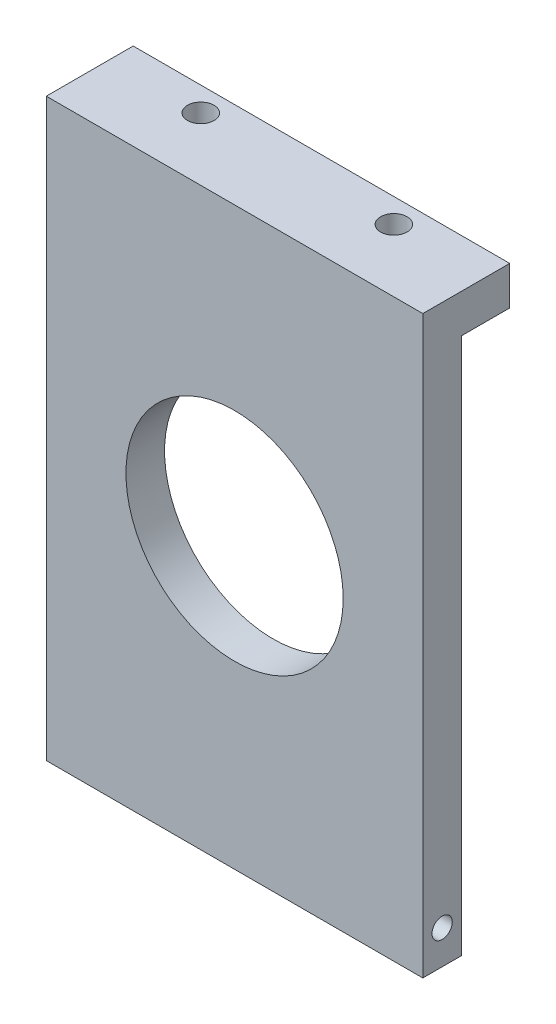
ISO-10303-21;
HEADER;
FILE_DESCRIPTION(('STEP AP214'),'2;1');
FILE_NAME('part.step','',(''),(''),'','','');
FILE_SCHEMA(('AUTOMOTIVE_DESIGN { 1 0 10303 214 1 1 1 1 }'));
ENDSEC;
DATA;
#1=APPLICATION_CONTEXT('core data for automotive mechanical design processes');
#2=APPLICATION_PROTOCOL_DEFINITION('international standard','automotive_design',2000,#1);
#3=PRODUCT_CONTEXT('',#1,'mechanical');
#4=PRODUCT('Part','Part','',(#3));
#5=PRODUCT_RELATED_PRODUCT_CATEGORY('part','',(#4));
#6=PRODUCT_DEFINITION_FORMATION('','',#4);
#7=PRODUCT_DEFINITION_CONTEXT('part definition',#1,'design');
#8=PRODUCT_DEFINITION('design','',#6,#7);
#9=PRODUCT_DEFINITION_SHAPE('','',#8);
#10=(LENGTH_UNIT() NAMED_UNIT(*) SI_UNIT(.MILLI.,.METRE.));
#11=(NAMED_UNIT(*) PLANE_ANGLE_UNIT() SI_UNIT($,.RADIAN.));
#12=(NAMED_UNIT(*) SI_UNIT($,.STERADIAN.) SOLID_ANGLE_UNIT());
#13=UNCERTAINTY_MEASURE_WITH_UNIT(LENGTH_MEASURE(1.E-05),#10,'distance_accuracy_value','');
#14=(GEOMETRIC_REPRESENTATION_CONTEXT(3) GLOBAL_UNCERTAINTY_ASSIGNED_CONTEXT((#13)) GLOBAL_UNIT_ASSIGNED_CONTEXT((#10,
#11,#12)) REPRESENTATION_CONTEXT('',''));
#15=CARTESIAN_POINT('',(0.,0.,0.));
#16=DIRECTION('',(0.,0.,1.));
#17=DIRECTION('',(1.,0.,0.));
#18=AXIS2_PLACEMENT_3D('',#15,#16,#17);
#19=CARTESIAN_POINT('',(0.,0.,8.));
#20=DIRECTION('',(0.,0.,1.));
#21=DIRECTION('',(1.,0.,0.));
#22=AXIS2_PLACEMENT_3D('',#19,#20,#21);
#23=PLANE('',#22);
#24=CARTESIAN_POINT('',(-38.9999999999997,59.8150000000004,8.));
#25=DIRECTION('',(0.,0.,1.));
#26=DIRECTION('',(1.,0.,0.));
#27=AXIS2_PLACEMENT_3D('',#24,#25,#26);
#28=CIRCLE('',#27,22.5);
#29=CARTESIAN_POINT('',(-16.4999999999997,59.8150000000004,8.));
#30=VERTEX_POINT('',#29);
#31=EDGE_CURVE('E169',#30,#30,#28,.T.);
#32=ORIENTED_EDGE('',*,*,#31,.F.);
#33=EDGE_LOOP('',(#32));
#34=FACE_BOUND('',#33,.T.);
#35=DIRECTION('',(0.,1.,0.));
#36=VECTOR('',#35,1.);
#37=CARTESIAN_POINT('',(0.,0.,8.));
#38=LINE('',#37,#36);
#39=CARTESIAN_POINT('',(0.,0.,8.));
#40=VERTEX_POINT('',#39);
#41=CARTESIAN_POINT('',(0.,119.2,8.));
#42=VERTEX_POINT('',#41);
#43=EDGE_CURVE('E175',#40,#42,#38,.T.);
#44=ORIENTED_EDGE('',*,*,#43,.T.);
#45=DIRECTION('',(1.,0.,0.));
#46=VECTOR('',#45,1.);
#47=CARTESIAN_POINT('',(-77.9999999999994,119.2,8.));
#48=LINE('',#47,#46);
#49=CARTESIAN_POINT('',(-77.9999999999994,119.2,8.));
#50=VERTEX_POINT('',#49);
#51=EDGE_CURVE('E137',#50,#42,#48,.T.);
#52=ORIENTED_EDGE('',*,*,#51,.F.);
#53=DIRECTION('',(0.,-1.,0.));
#54=VECTOR('',#53,1.);
#55=CARTESIAN_POINT('',(-77.9999999999994,119.63,8.));
#56=LINE('',#55,#54);
#57=CARTESIAN_POINT('',(-77.9999999999994,0.,8.));
#58=VERTEX_POINT('',#57);
#59=EDGE_CURVE('E178',#50,#58,#56,.T.);
#60=ORIENTED_EDGE('',*,*,#59,.T.);
#61=DIRECTION('',(1.,0.,0.));
#62=VECTOR('',#61,1.);
#63=CARTESIAN_POINT('',(-77.9999999999994,0.,8.));
#64=LINE('',#63,#62);
#65=EDGE_CURVE('E181',#58,#40,#64,.T.);
#66=ORIENTED_EDGE('',*,*,#65,.T.);
#67=EDGE_LOOP('',(#44,#52,#60,#66));
#68=FACE_BOUND('',#67,.T.);
#69=ADVANCED_FACE('F38',(#34,#68),#23,.T.);
#70=CARTESIAN_POINT('',(0.,0.,8.));
#71=DIRECTION('',(-1.,0.,0.));
#72=DIRECTION('',(0.,0.,1.));
#73=AXIS2_PLACEMENT_3D('',#70,#71,#72);
#74=PLANE('',#73);
#75=CARTESIAN_POINT('',(0.,6.99999999999998,3.99999999999984));
#76=DIRECTION('',(1.,0.,0.));
#77=DIRECTION('',(0.,0.,-1.));
#78=AXIS2_PLACEMENT_3D('',#75,#76,#77);
#79=CIRCLE('',#78,2.1);
#80=CARTESIAN_POINT('',(0.,6.99999999999998,1.89999999999984));
#81=VERTEX_POINT('',#80);
#82=EDGE_CURVE('E113',#81,#81,#79,.T.);
#83=ORIENTED_EDGE('',*,*,#82,.F.);
#84=EDGE_LOOP('',(#83));
#85=FACE_BOUND('',#84,.T.);
#86=DIRECTION('',(0.,0.,-1.));
#87=VECTOR('',#86,1.);
#88=CARTESIAN_POINT('',(0.,119.2,-10.));
#89=LINE('',#88,#87);
#90=CARTESIAN_POINT('',(0.,119.2,-10.));
#91=VERTEX_POINT('',#90);
#92=EDGE_CURVE('E53',#42,#91,#89,.T.);
#93=ORIENTED_EDGE('',*,*,#92,.F.);
#94=ORIENTED_EDGE('',*,*,#43,.F.);
#95=DIRECTION('',(0.,0.,-1.));
#96=VECTOR('',#95,1.);
#97=CARTESIAN_POINT('',(0.,0.,8.));
#98=LINE('',#97,#96);
#99=CARTESIAN_POINT('',(0.,0.,0.));
#100=VERTEX_POINT('',#99);
#101=EDGE_CURVE('E46',#40,#100,#98,.T.);
#102=ORIENTED_EDGE('',*,*,#101,.T.);
#103=DIRECTION('',(0.,1.,0.));
#104=VECTOR('',#103,1.);
#105=CARTESIAN_POINT('',(0.,0.,0.));
#106=LINE('',#105,#104);
#107=CARTESIAN_POINT('',(0.,111.2,0.));
#108=VERTEX_POINT('',#107);
#109=EDGE_CURVE('E172',#100,#108,#106,.T.);
#110=ORIENTED_EDGE('',*,*,#109,.T.);
#111=DIRECTION('',(0.,0.,1.));
#112=VECTOR('',#111,1.);
#113=CARTESIAN_POINT('',(0.,111.2,-10.));
#114=LINE('',#113,#112);
#115=CARTESIAN_POINT('',(0.,111.2,-10.));
#116=VERTEX_POINT('',#115);
#117=EDGE_CURVE('E153',#116,#108,#114,.T.);
#118=ORIENTED_EDGE('',*,*,#117,.F.);
#119=DIRECTION('',(0.,-1.,0.));
#120=VECTOR('',#119,1.);
#121=CARTESIAN_POINT('',(0.,119.63,-10.));
#122=LINE('',#121,#120);
#123=EDGE_CURVE('E145',#91,#116,#122,.T.);
#124=ORIENTED_EDGE('',*,*,#123,.F.);
#125=EDGE_LOOP('',(#93,#94,#102,#110,#118,#124));
#126=FACE_BOUND('',#125,.T.);
#127=ADVANCED_FACE('F40',(#85,#126),#74,.F.);
#128=CARTESIAN_POINT('',(-77.9999999999994,119.63,8.));
#129=DIRECTION('',(1.,0.,0.));
#130=DIRECTION('',(0.,0.,-1.));
#131=AXIS2_PLACEMENT_3D('',#128,#129,#130);
#132=PLANE('',#131);
#133=CARTESIAN_POINT('',(-77.9999999999994,6.99999999999998,3.99999999999984));
#134=DIRECTION('',(-1.,0.,0.));
#135=DIRECTION('',(0.,0.,1.));
#136=AXIS2_PLACEMENT_3D('',#133,#134,#135);
#137=CIRCLE('',#136,2.1);
#138=CARTESIAN_POINT('',(-77.9999999999994,6.99999999999998,6.09999999999984));
#139=VERTEX_POINT('',#138);
#140=EDGE_CURVE('E112',#139,#139,#137,.T.);
#141=ORIENTED_EDGE('',*,*,#140,.F.);
#142=EDGE_LOOP('',(#141));
#143=FACE_BOUND('',#142,.T.);
#144=DIRECTION('',(0.,0.,1.));
#145=VECTOR('',#144,1.);
#146=CARTESIAN_POINT('',(-77.9999999999994,119.2,-10.));
#147=LINE('',#146,#145);
#148=CARTESIAN_POINT('',(-77.9999999999994,119.2,-10.));
#149=VERTEX_POINT('',#148);
#150=EDGE_CURVE('E133',#149,#50,#147,.T.);
#151=ORIENTED_EDGE('',*,*,#150,.F.);
#152=DIRECTION('',(0.,1.,0.));
#153=VECTOR('',#152,1.);
#154=CARTESIAN_POINT('',(-77.9999999999994,119.63,-10.));
#155=LINE('',#154,#153);
#156=CARTESIAN_POINT('',(-77.9999999999994,111.2,-10.));
#157=VERTEX_POINT('',#156);
#158=EDGE_CURVE('E142',#157,#149,#155,.T.);
#159=ORIENTED_EDGE('',*,*,#158,.F.);
#160=DIRECTION('',(0.,0.,1.));
#161=VECTOR('',#160,1.);
#162=CARTESIAN_POINT('',(-77.9999999999994,111.2,-10.));
#163=LINE('',#162,#161);
#164=CARTESIAN_POINT('',(-77.9999999999994,111.2,0.));
#165=VERTEX_POINT('',#164);
#166=EDGE_CURVE('E149',#157,#165,#163,.T.);
#167=ORIENTED_EDGE('',*,*,#166,.T.);
#168=DIRECTION('',(0.,-1.,0.));
#169=VECTOR('',#168,1.);
#170=CARTESIAN_POINT('',(-77.9999999999994,119.63,0.));
#171=LINE('',#170,#169);
#172=CARTESIAN_POINT('',(-77.9999999999994,0.,0.));
#173=VERTEX_POINT('',#172);
#174=EDGE_CURVE('E184',#165,#173,#171,.T.);
#175=ORIENTED_EDGE('',*,*,#174,.T.);
#176=DIRECTION('',(0.,0.,-1.));
#177=VECTOR('',#176,1.);
#178=CARTESIAN_POINT('',(-77.9999999999994,0.,8.));
#179=LINE('',#178,#177);
#180=EDGE_CURVE('E11',#58,#173,#179,.T.);
#181=ORIENTED_EDGE('',*,*,#180,.F.);
#182=ORIENTED_EDGE('',*,*,#59,.F.);
#183=EDGE_LOOP('',(#151,#159,#167,#175,#181,#182));
#184=FACE_BOUND('',#183,.T.);
#185=ADVANCED_FACE('F200',(#143,#184),#132,.F.);
#186=CARTESIAN_POINT('',(0.,0.,-10.));
#187=DIRECTION('',(0.,0.,1.));
#188=DIRECTION('',(1.,0.,0.));
#189=AXIS2_PLACEMENT_3D('',#186,#187,#188);
#190=PLANE('',#189);
#191=DIRECTION('',(-1.,0.,0.));
#192=VECTOR('',#191,1.);
#193=CARTESIAN_POINT('',(-77.9999999999994,119.2,-10.));
#194=LINE('',#193,#192);
#195=EDGE_CURVE('E140',#91,#149,#194,.T.);
#196=ORIENTED_EDGE('',*,*,#195,.F.);
#197=ORIENTED_EDGE('',*,*,#123,.T.);
#198=DIRECTION('',(-1.,0.,0.));
#199=VECTOR('',#198,1.);
#200=CARTESIAN_POINT('',(-77.9999999999994,111.2,-10.));
#201=LINE('',#200,#199);
#202=EDGE_CURVE('E147',#116,#157,#201,.T.);
#203=ORIENTED_EDGE('',*,*,#202,.T.);
#204=ORIENTED_EDGE('',*,*,#158,.T.);
#205=EDGE_LOOP('',(#196,#197,#203,#204));
#206=FACE_BOUND('',#205,.T.);
#207=ADVANCED_FACE('F208',(#206),#190,.F.);
#208=CARTESIAN_POINT('',(0.,0.,0.));
#209=DIRECTION('',(0.,0.,1.));
#210=DIRECTION('',(1.,0.,0.));
#211=AXIS2_PLACEMENT_3D('',#208,#209,#210);
#212=PLANE('',#211);
#213=CARTESIAN_POINT('',(-38.9999999999997,59.8150000000004,0.));
#214=DIRECTION('',(0.,0.,1.));
#215=DIRECTION('',(1.,0.,0.));
#216=AXIS2_PLACEMENT_3D('',#213,#214,#215);
#217=CIRCLE('',#216,22.5);
#218=CARTESIAN_POINT('',(-16.4999999999997,59.8150000000004,0.));
#219=VERTEX_POINT('',#218);
#220=EDGE_CURVE('E168',#219,#219,#217,.T.);
#221=ORIENTED_EDGE('',*,*,#220,.T.);
#222=EDGE_LOOP('',(#221));
#223=FACE_BOUND('',#222,.T.);
#224=DIRECTION('',(-1.,0.,0.));
#225=VECTOR('',#224,1.);
#226=CARTESIAN_POINT('',(-77.9999999999994,111.2,0.));
#227=LINE('',#226,#225);
#228=EDGE_CURVE('E61',#108,#165,#227,.T.);
#229=ORIENTED_EDGE('',*,*,#228,.F.);
#230=ORIENTED_EDGE('',*,*,#109,.F.);
#231=DIRECTION('',(1.,0.,0.));
#232=VECTOR('',#231,1.);
#233=CARTESIAN_POINT('',(-77.9999999999994,0.,0.));
#234=LINE('',#233,#232);
#235=EDGE_CURVE('E179',#173,#100,#234,.T.);
#236=ORIENTED_EDGE('',*,*,#235,.F.);
#237=ORIENTED_EDGE('',*,*,#174,.F.);
#238=EDGE_LOOP('',(#229,#230,#236,#237));
#239=FACE_BOUND('',#238,.T.);
#240=ADVANCED_FACE('F194',(#223,#239),#212,.F.);
#241=CARTESIAN_POINT('',(-77.9999999999994,0.,8.));
#242=DIRECTION('',(0.,1.,0.));
#243=DIRECTION('',(0.,0.,1.));
#244=AXIS2_PLACEMENT_3D('',#241,#242,#243);
#245=PLANE('',#244);
#246=CARTESIAN_POINT('',(-67.9999999999997,0.,4.00000000000001));
#247=DIRECTION('',(0.,-1.,0.));
#248=DIRECTION('',(0.,0.,-1.));
#249=AXIS2_PLACEMENT_3D('',#246,#247,#248);
#250=CIRCLE('',#249,2.09999999999999);
#251=CARTESIAN_POINT('',(-67.9999999999997,0.,1.90000000000002));
#252=VERTEX_POINT('',#251);
#253=EDGE_CURVE('E156',#252,#252,#250,.T.);
#254=ORIENTED_EDGE('',*,*,#253,.F.);
#255=EDGE_LOOP('',(#254));
#256=FACE_BOUND('',#255,.T.);
#257=CARTESIAN_POINT('',(-9.9999999999997,0.,4.));
#258=DIRECTION('',(0.,-1.,0.));
#259=DIRECTION('',(0.,0.,-1.));
#260=AXIS2_PLACEMENT_3D('',#257,#258,#259);
#261=CIRCLE('',#260,2.09999999999999);
#262=CARTESIAN_POINT('',(-9.9999999999997,0.,1.90000000000001));
#263=VERTEX_POINT('',#262);
#264=EDGE_CURVE('E162',#263,#263,#261,.T.);
#265=ORIENTED_EDGE('',*,*,#264,.F.);
#266=EDGE_LOOP('',(#265));
#267=FACE_BOUND('',#266,.T.);
#268=ORIENTED_EDGE('',*,*,#235,.T.);
#269=ORIENTED_EDGE('',*,*,#101,.F.);
#270=ORIENTED_EDGE('',*,*,#65,.F.);
#271=ORIENTED_EDGE('',*,*,#180,.T.);
#272=EDGE_LOOP('',(#268,#269,#270,#271));
#273=FACE_BOUND('',#272,.T.);
#274=ADVANCED_FACE('F195',(#256,#267,#273),#245,.F.);
#275=CARTESIAN_POINT('',(-38.9999999999997,59.8150000000004,8.));
#276=DIRECTION('',(0.,0.,-1.));
#277=DIRECTION('',(-1.,0.,0.));
#278=AXIS2_PLACEMENT_3D('',#275,#276,#277);
#279=CYLINDRICAL_SURFACE('',#278,22.5);
#280=ORIENTED_EDGE('',*,*,#31,.T.);
#281=EDGE_LOOP('',(#280));
#282=FACE_BOUND('',#281,.T.);
#283=ORIENTED_EDGE('',*,*,#220,.F.);
#284=EDGE_LOOP('',(#283));
#285=FACE_BOUND('',#284,.T.);
#286=ADVANCED_FACE('F224',(#282,#285),#279,.F.);
#287=CARTESIAN_POINT('',(-9.9999999999997,12.4,4.));
#288=DIRECTION('',(0.,-1.,0.));
#289=DIRECTION('',(0.,0.,-1.));
#290=AXIS2_PLACEMENT_3D('',#287,#288,#289);
#291=CONICAL_SURFACE('',#290,2.09999999999999,1.02974425867665);
#292=CARTESIAN_POINT('',(-9.9999999999997,13.6618072999579,4.));
#293=VERTEX_POINT('',#292);
#294=VERTEX_LOOP('',#293);
#295=FACE_BOUND('',#294,.T.);
#296=CARTESIAN_POINT('',(-9.9999999999997,12.4,4.));
#297=DIRECTION('',(0.,-1.,0.));
#298=DIRECTION('',(0.,0.,-1.));
#299=AXIS2_PLACEMENT_3D('',#296,#297,#298);
#300=CIRCLE('',#299,2.09999999999999);
#301=CARTESIAN_POINT('',(-9.9999999999997,12.4,1.90000000000001));
#302=VERTEX_POINT('',#301);
#303=EDGE_CURVE('E165',#302,#302,#300,.T.);
#304=ORIENTED_EDGE('',*,*,#303,.T.);
#305=EDGE_LOOP('',(#304));
#306=FACE_BOUND('',#305,.T.);
#307=ADVANCED_FACE('F276',(#295,#306),#291,.F.);
#308=CARTESIAN_POINT('',(-9.9999999999997,0.,4.));
#309=DIRECTION('',(0.,-1.,0.));
#310=DIRECTION('',(0.,0.,-1.));
#311=AXIS2_PLACEMENT_3D('',#308,#309,#310);
#312=CYLINDRICAL_SURFACE('',#311,2.09999999999999);
#313=ORIENTED_EDGE('',*,*,#303,.F.);
#314=EDGE_LOOP('',(#313));
#315=FACE_BOUND('',#314,.T.);
#316=ORIENTED_EDGE('',*,*,#264,.T.);
#317=EDGE_LOOP('',(#316));
#318=FACE_BOUND('',#317,.T.);
#319=ADVANCED_FACE('F273',(#315,#318),#312,.F.);
#320=CARTESIAN_POINT('',(-67.9999999999997,12.4,4.00000000000001));
#321=DIRECTION('',(0.,-1.,0.));
#322=DIRECTION('',(0.,0.,-1.));
#323=AXIS2_PLACEMENT_3D('',#320,#321,#322);
#324=CONICAL_SURFACE('',#323,2.09999999999999,1.02974425867666);
#325=CARTESIAN_POINT('',(-67.9999999999997,13.6618072999579,4.00000000000001));
#326=VERTEX_POINT('',#325);
#327=VERTEX_LOOP('',#326);
#328=FACE_BOUND('',#327,.T.);
#329=CARTESIAN_POINT('',(-67.9999999999997,12.4,4.00000000000001));
#330=DIRECTION('',(0.,-1.,0.));
#331=DIRECTION('',(0.,0.,-1.));
#332=AXIS2_PLACEMENT_3D('',#329,#330,#331);
#333=CIRCLE('',#332,2.09999999999999);
#334=CARTESIAN_POINT('',(-67.9999999999997,12.4,1.90000000000002));
#335=VERTEX_POINT('',#334);
#336=EDGE_CURVE('E159',#335,#335,#333,.T.);
#337=ORIENTED_EDGE('',*,*,#336,.T.);
#338=EDGE_LOOP('',(#337));
#339=FACE_BOUND('',#338,.T.);
#340=ADVANCED_FACE('F269',(#328,#339),#324,.F.);
#341=CARTESIAN_POINT('',(-67.9999999999997,0.,4.00000000000001));
#342=DIRECTION('',(0.,-1.,0.));
#343=DIRECTION('',(0.,0.,-1.));
#344=AXIS2_PLACEMENT_3D('',#341,#342,#343);
#345=CYLINDRICAL_SURFACE('',#344,2.09999999999999);
#346=ORIENTED_EDGE('',*,*,#336,.F.);
#347=EDGE_LOOP('',(#346));
#348=FACE_BOUND('',#347,.T.);
#349=ORIENTED_EDGE('',*,*,#253,.T.);
#350=EDGE_LOOP('',(#349));
#351=FACE_BOUND('',#350,.T.);
#352=ADVANCED_FACE('F265',(#348,#351),#345,.F.);
#353=CARTESIAN_POINT('',(-77.9999999999994,111.2,-10.));
#354=DIRECTION('',(0.,1.,0.));
#355=DIRECTION('',(-1.,0.,0.));
#356=AXIS2_PLACEMENT_3D('',#353,#354,#355);
#357=PLANE('',#356);
#358=CARTESIAN_POINT('',(-18.9999999999997,111.2,-5.));
#359=DIRECTION('',(0.,-1.,0.));
#360=DIRECTION('',(-1.,0.,0.));
#361=AXIS2_PLACEMENT_3D('',#358,#359,#360);
#362=CIRCLE('',#361,2.75);
#363=CARTESIAN_POINT('',(-21.7499999999997,111.2,-5.));
#364=VERTEX_POINT('',#363);
#365=EDGE_CURVE('E123',#364,#364,#362,.T.);
#366=ORIENTED_EDGE('',*,*,#365,.F.);
#367=EDGE_LOOP('',(#366));
#368=FACE_BOUND('',#367,.T.);
#369=CARTESIAN_POINT('',(-58.9999999999997,111.2,-5.));
#370=DIRECTION('',(0.,-1.,0.));
#371=DIRECTION('',(1.,0.,0.));
#372=AXIS2_PLACEMENT_3D('',#369,#370,#371);
#373=CIRCLE('',#372,2.75);
#374=CARTESIAN_POINT('',(-56.2499999999997,111.2,-5.));
#375=VERTEX_POINT('',#374);
#376=EDGE_CURVE('E127',#375,#375,#373,.T.);
#377=ORIENTED_EDGE('',*,*,#376,.F.);
#378=EDGE_LOOP('',(#377));
#379=FACE_BOUND('',#378,.T.);
#380=ORIENTED_EDGE('',*,*,#228,.T.);
#381=ORIENTED_EDGE('',*,*,#166,.F.);
#382=ORIENTED_EDGE('',*,*,#202,.F.);
#383=ORIENTED_EDGE('',*,*,#117,.T.);
#384=EDGE_LOOP('',(#380,#381,#382,#383));
#385=FACE_BOUND('',#384,.T.);
#386=ADVANCED_FACE('F205',(#368,#379,#385),#357,.F.);
#387=CARTESIAN_POINT('',(0.,119.2,0.));
#388=DIRECTION('',(0.,1.,0.));
#389=DIRECTION('',(0.,0.,1.));
#390=AXIS2_PLACEMENT_3D('',#387,#388,#389);
#391=PLANE('',#390);
#392=CARTESIAN_POINT('',(-18.9999999999997,119.2,-5.));
#393=DIRECTION('',(0.,-1.,0.));
#394=DIRECTION('',(-1.,0.,0.));
#395=AXIS2_PLACEMENT_3D('',#392,#393,#394);
#396=CIRCLE('',#395,2.75);
#397=CARTESIAN_POINT('',(-21.7499999999997,119.2,-5.));
#398=VERTEX_POINT('',#397);
#399=EDGE_CURVE('E124',#398,#398,#396,.T.);
#400=ORIENTED_EDGE('',*,*,#399,.T.);
#401=EDGE_LOOP('',(#400));
#402=FACE_BOUND('',#401,.T.);
#403=CARTESIAN_POINT('',(-58.9999999999997,119.2,-5.));
#404=DIRECTION('',(0.,-1.,0.));
#405=DIRECTION('',(1.,0.,0.));
#406=AXIS2_PLACEMENT_3D('',#403,#404,#405);
#407=CIRCLE('',#406,2.75);
#408=CARTESIAN_POINT('',(-56.2499999999997,119.2,-5.));
#409=VERTEX_POINT('',#408);
#410=EDGE_CURVE('E130',#409,#409,#407,.T.);
#411=ORIENTED_EDGE('',*,*,#410,.T.);
#412=EDGE_LOOP('',(#411));
#413=FACE_BOUND('',#412,.T.);
#414=ORIENTED_EDGE('',*,*,#150,.T.);
#415=ORIENTED_EDGE('',*,*,#51,.T.);
#416=ORIENTED_EDGE('',*,*,#92,.T.);
#417=ORIENTED_EDGE('',*,*,#195,.T.);
#418=EDGE_LOOP('',(#414,#415,#416,#417));
#419=FACE_BOUND('',#418,.T.);
#420=ADVANCED_FACE('F209',(#402,#413,#419),#391,.T.);
#421=CARTESIAN_POINT('',(-58.9999999999997,119.2,-5.));
#422=DIRECTION('',(0.,-1.,0.));
#423=DIRECTION('',(1.,0.,0.));
#424=AXIS2_PLACEMENT_3D('',#421,#422,#423);
#425=CYLINDRICAL_SURFACE('',#424,2.75);
#426=ORIENTED_EDGE('',*,*,#410,.F.);
#427=EDGE_LOOP('',(#426));
#428=FACE_BOUND('',#427,.T.);
#429=ORIENTED_EDGE('',*,*,#376,.T.);
#430=EDGE_LOOP('',(#429));
#431=FACE_BOUND('',#430,.T.);
#432=ADVANCED_FACE('F255',(#428,#431),#425,.F.);
#433=CARTESIAN_POINT('',(-18.9999999999997,119.2,-5.));
#434=DIRECTION('',(0.,-1.,0.));
#435=DIRECTION('',(1.,0.,0.));
#436=AXIS2_PLACEMENT_3D('',#433,#434,#435);
#437=CYLINDRICAL_SURFACE('',#436,2.75);
#438=ORIENTED_EDGE('',*,*,#399,.F.);
#439=EDGE_LOOP('',(#438));
#440=FACE_BOUND('',#439,.T.);
#441=ORIENTED_EDGE('',*,*,#365,.T.);
#442=EDGE_LOOP('',(#441));
#443=FACE_BOUND('',#442,.T.);
#444=ADVANCED_FACE('F247',(#440,#443),#437,.F.);
#445=CARTESIAN_POINT('',(-71.9999999999994,6.99999999999998,3.99999999999984));
#446=DIRECTION('',(-1.,0.,0.));
#447=DIRECTION('',(0.,0.,1.));
#448=AXIS2_PLACEMENT_3D('',#445,#446,#447);
#449=CONICAL_SURFACE('',#448,2.1,1.02974425867666);
#450=CARTESIAN_POINT('',(-70.7381927000415,6.99999999999998,3.99999999999984));
#451=VERTEX_POINT('',#450);
#452=VERTEX_LOOP('',#451);
#453=FACE_BOUND('',#452,.T.);
#454=CARTESIAN_POINT('',(-71.9999999999994,6.99999999999998,3.99999999999984));
#455=DIRECTION('',(-1.,0.,0.));
#456=DIRECTION('',(0.,0.,1.));
#457=AXIS2_PLACEMENT_3D('',#454,#455,#456);
#458=CIRCLE('',#457,2.1);
#459=CARTESIAN_POINT('',(-71.9999999999994,6.99999999999998,6.09999999999984));
#460=VERTEX_POINT('',#459);
#461=EDGE_CURVE('E116',#460,#460,#458,.T.);
#462=ORIENTED_EDGE('',*,*,#461,.T.);
#463=EDGE_LOOP('',(#462));
#464=FACE_BOUND('',#463,.T.);
#465=ADVANCED_FACE('F241',(#453,#464),#449,.F.);
#466=CARTESIAN_POINT('',(-77.9999999999994,6.99999999999998,3.99999999999984));
#467=DIRECTION('',(-1.,0.,0.));
#468=DIRECTION('',(0.,0.,1.));
#469=AXIS2_PLACEMENT_3D('',#466,#467,#468);
#470=CYLINDRICAL_SURFACE('',#469,2.1);
#471=ORIENTED_EDGE('',*,*,#461,.F.);
#472=EDGE_LOOP('',(#471));
#473=FACE_BOUND('',#472,.T.);
#474=ORIENTED_EDGE('',*,*,#140,.T.);
#475=EDGE_LOOP('',(#474));
#476=FACE_BOUND('',#475,.T.);
#477=ADVANCED_FACE('F106',(#473,#476),#470,.F.);
#478=CARTESIAN_POINT('',(-6.,6.99999999999998,3.99999999999984));
#479=DIRECTION('',(1.,0.,0.));
#480=DIRECTION('',(0.,0.,-1.));
#481=AXIS2_PLACEMENT_3D('',#478,#479,#480);
#482=CONICAL_SURFACE('',#481,2.1,1.02974425867665);
#483=CARTESIAN_POINT('',(-7.26180729995788,6.99999999999998,3.99999999999984));
#484=VERTEX_POINT('',#483);
#485=VERTEX_LOOP('',#484);
#486=FACE_BOUND('',#485,.T.);
#487=CARTESIAN_POINT('',(-6.,6.99999999999998,3.99999999999984));
#488=DIRECTION('',(1.,0.,0.));
#489=DIRECTION('',(0.,0.,-1.));
#490=AXIS2_PLACEMENT_3D('',#487,#488,#489);
#491=CIRCLE('',#490,2.1);
#492=CARTESIAN_POINT('',(-6.,6.99999999999998,1.89999999999985));
#493=VERTEX_POINT('',#492);
#494=EDGE_CURVE('E110',#493,#493,#491,.T.);
#495=ORIENTED_EDGE('',*,*,#494,.T.);
#496=EDGE_LOOP('',(#495));
#497=FACE_BOUND('',#496,.T.);
#498=ADVANCED_FACE('F102',(#486,#497),#482,.F.);
#499=CARTESIAN_POINT('',(0.,6.99999999999998,3.99999999999984));
#500=DIRECTION('',(1.,0.,0.));
#501=DIRECTION('',(0.,0.,-1.));
#502=AXIS2_PLACEMENT_3D('',#499,#500,#501);
#503=CYLINDRICAL_SURFACE('',#502,2.1);
#504=ORIENTED_EDGE('',*,*,#494,.F.);
#505=EDGE_LOOP('',(#504));
#506=FACE_BOUND('',#505,.T.);
#507=ORIENTED_EDGE('',*,*,#82,.T.);
#508=EDGE_LOOP('',(#507));
#509=FACE_BOUND('',#508,.T.);
#510=ADVANCED_FACE('F105',(#506,#509),#503,.F.);
#511=CLOSED_SHELL('',(#69,#127,#185,#207,#240,#274,#286,#307,#319,#340,#352,#386,#420,#432,#444,
#465,#477,#498,#510));
#512=MANIFOLD_SOLID_BREP('B2',#511);
#513=ADVANCED_BREP_SHAPE_REPRESENTATION('',(#18,#512),#14);
#514=SHAPE_DEFINITION_REPRESENTATION(#9,#513);
ENDSEC;
END-ISO-10303-21;
